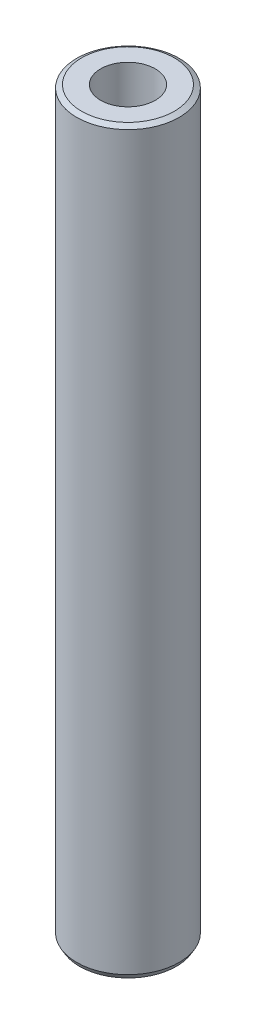
ISO-10303-21;
HEADER;
FILE_DESCRIPTION(('STEP AP214'),'2;1');
FILE_NAME('part.step','',(''),(''),'','','');
FILE_SCHEMA(('AUTOMOTIVE_DESIGN { 1 0 10303 214 1 1 1 1 }'));
ENDSEC;
DATA;
#1=APPLICATION_CONTEXT('core data for automotive mechanical design processes');
#2=APPLICATION_PROTOCOL_DEFINITION('international standard','automotive_design',2000,#1);
#3=PRODUCT_CONTEXT('',#1,'mechanical');
#4=PRODUCT('Part','Part','',(#3));
#5=PRODUCT_RELATED_PRODUCT_CATEGORY('part','',(#4));
#6=PRODUCT_DEFINITION_FORMATION('','',#4);
#7=PRODUCT_DEFINITION_CONTEXT('part definition',#1,'design');
#8=PRODUCT_DEFINITION('design','',#6,#7);
#9=PRODUCT_DEFINITION_SHAPE('','',#8);
#10=(LENGTH_UNIT() NAMED_UNIT(*) SI_UNIT(.MILLI.,.METRE.));
#11=(NAMED_UNIT(*) PLANE_ANGLE_UNIT() SI_UNIT($,.RADIAN.));
#12=(NAMED_UNIT(*) SI_UNIT($,.STERADIAN.) SOLID_ANGLE_UNIT());
#13=UNCERTAINTY_MEASURE_WITH_UNIT(LENGTH_MEASURE(1.E-05),#10,'distance_accuracy_value','');
#14=(GEOMETRIC_REPRESENTATION_CONTEXT(3) GLOBAL_UNCERTAINTY_ASSIGNED_CONTEXT((#13)) GLOBAL_UNIT_ASSIGNED_CONTEXT((#10,
#11,#12)) REPRESENTATION_CONTEXT('',''));
#15=CARTESIAN_POINT('',(0.,0.,0.));
#16=DIRECTION('',(0.,0.,1.));
#17=DIRECTION('',(1.,0.,0.));
#18=AXIS2_PLACEMENT_3D('',#15,#16,#17);
#19=CARTESIAN_POINT('',(0.,288.719500473334,0.));
#20=DIRECTION('',(0.,-1.,0.));
#21=DIRECTION('',(0.,0.,-1.));
#22=AXIS2_PLACEMENT_3D('',#19,#20,#21);
#23=CYLINDRICAL_SURFACE('',#22,20.);
#24=CARTESIAN_POINT('',(0.,287.617443691525,0.));
#25=DIRECTION('',(0.,1.,0.));
#26=DIRECTION('',(0.,0.,1.));
#27=AXIS2_PLACEMENT_3D('',#24,#25,#26);
#28=CIRCLE('',#27,20.);
#29=CARTESIAN_POINT('',(0.,287.617443691525,20.));
#30=VERTEX_POINT('',#29);
#31=EDGE_CURVE('E50',#30,#30,#28,.F.);
#32=ORIENTED_EDGE('',*,*,#31,.T.);
#33=EDGE_LOOP('',(#32));
#34=FACE_BOUND('',#33,.T.);
#35=CARTESIAN_POINT('',(0.,1.90881833891887,0.));
#36=DIRECTION('',(0.,1.,0.));
#37=DIRECTION('',(0.,0.,1.));
#38=AXIS2_PLACEMENT_3D('',#35,#36,#37);
#39=CIRCLE('',#38,20.);
#40=CARTESIAN_POINT('',(0.,1.90881833891887,20.));
#41=VERTEX_POINT('',#40);
#42=EDGE_CURVE('E51',#41,#41,#39,.T.);
#43=ORIENTED_EDGE('',*,*,#42,.T.);
#44=EDGE_LOOP('',(#43));
#45=FACE_BOUND('',#44,.T.);
#46=ADVANCED_FACE('F39',(#34,#45),#23,.T.);
#47=CARTESIAN_POINT('',(0.,288.719500473334,0.));
#48=DIRECTION('',(0.,1.,0.));
#49=DIRECTION('',(0.,0.,1.));
#50=AXIS2_PLACEMENT_3D('',#47,#48,#49);
#51=PLANE('',#50);
#52=CARTESIAN_POINT('',(0.,288.719500473334,0.));
#53=DIRECTION('',(0.,1.,0.));
#54=DIRECTION('',(0.,0.,1.));
#55=AXIS2_PLACEMENT_3D('',#52,#53,#54);
#56=CIRCLE('',#55,18.0911816610814);
#57=CARTESIAN_POINT('',(0.,288.719500473334,18.0911816610814));
#58=VERTEX_POINT('',#57);
#59=EDGE_CURVE('E54',#58,#58,#56,.T.);
#60=ORIENTED_EDGE('',*,*,#59,.T.);
#61=EDGE_LOOP('',(#60));
#62=FACE_BOUND('',#61,.T.);
#63=CARTESIAN_POINT('',(0.,288.719500473334,0.));
#64=DIRECTION('',(0.,1.,0.));
#65=DIRECTION('',(0.,0.,1.));
#66=AXIS2_PLACEMENT_3D('',#63,#64,#65);
#67=CIRCLE('',#66,10.6688998778868);
#68=CARTESIAN_POINT('',(0.,288.719500473334,10.6688998778868));
#69=VERTEX_POINT('',#68);
#70=EDGE_CURVE('E58',#69,#69,#67,.T.);
#71=ORIENTED_EDGE('',*,*,#70,.F.);
#72=EDGE_LOOP('',(#71));
#73=FACE_BOUND('',#72,.T.);
#74=ADVANCED_FACE('F69',(#62,#73),#51,.T.);
#75=CARTESIAN_POINT('',(0.,0.,0.));
#76=DIRECTION('',(0.,1.,0.));
#77=DIRECTION('',(0.,0.,1.));
#78=AXIS2_PLACEMENT_3D('',#75,#76,#77);
#79=PLANE('',#78);
#80=CARTESIAN_POINT('',(0.,0.,0.));
#81=DIRECTION('',(0.,1.,0.));
#82=DIRECTION('',(0.,0.,1.));
#83=AXIS2_PLACEMENT_3D('',#80,#81,#82);
#84=CIRCLE('',#83,18.8979432181911);
#85=CARTESIAN_POINT('',(0.,0.,18.8979432181911));
#86=VERTEX_POINT('',#85);
#87=EDGE_CURVE('E10',#86,#86,#84,.F.);
#88=ORIENTED_EDGE('',*,*,#87,.T.);
#89=EDGE_LOOP('',(#88));
#90=FACE_BOUND('',#89,.T.);
#91=CARTESIAN_POINT('',(0.,0.,0.));
#92=DIRECTION('',(0.,1.,0.));
#93=DIRECTION('',(0.,0.,1.));
#94=AXIS2_PLACEMENT_3D('',#91,#92,#93);
#95=CIRCLE('',#94,10.6688998778868);
#96=CARTESIAN_POINT('',(0.,0.,10.6688998778868));
#97=VERTEX_POINT('',#96);
#98=EDGE_CURVE('E63',#97,#97,#95,.T.);
#99=ORIENTED_EDGE('',*,*,#98,.T.);
#100=EDGE_LOOP('',(#99));
#101=FACE_BOUND('',#100,.T.);
#102=ADVANCED_FACE('F75',(#90,#101),#79,.F.);
#103=CARTESIAN_POINT('',(0.,288.719500473334,0.));
#104=DIRECTION('',(0.,-1.,0.));
#105=DIRECTION('',(0.,0.,-1.));
#106=AXIS2_PLACEMENT_3D('',#103,#104,#105);
#107=CYLINDRICAL_SURFACE('',#106,10.6688998778868);
#108=ORIENTED_EDGE('',*,*,#70,.T.);
#109=EDGE_LOOP('',(#108));
#110=FACE_BOUND('',#109,.T.);
#111=ORIENTED_EDGE('',*,*,#98,.F.);
#112=EDGE_LOOP('',(#111));
#113=FACE_BOUND('',#112,.T.);
#114=ADVANCED_FACE('F70',(#110,#113),#107,.F.);
#115=CARTESIAN_POINT('',(0.,288.719500473334,0.));
#116=DIRECTION('',(0.,-1.,0.));
#117=DIRECTION('',(0.,0.,-1.));
#118=AXIS2_PLACEMENT_3D('',#115,#116,#117);
#119=CONICAL_SURFACE('',#118,18.0911816610814,1.04719755119658);
#120=ORIENTED_EDGE('',*,*,#31,.F.);
#121=EDGE_LOOP('',(#120));
#122=FACE_BOUND('',#121,.T.);
#123=ORIENTED_EDGE('',*,*,#59,.F.);
#124=EDGE_LOOP('',(#123));
#125=FACE_BOUND('',#124,.T.);
#126=ADVANCED_FACE('F81',(#122,#125),#119,.T.);
#127=CARTESIAN_POINT('',(0.,1.90881833891887,0.));
#128=DIRECTION('',(0.,1.,0.));
#129=DIRECTION('',(0.,0.,1.));
#130=AXIS2_PLACEMENT_3D('',#127,#128,#129);
#131=CONICAL_SURFACE('',#130,20.,0.523598775598306);
#132=ORIENTED_EDGE('',*,*,#87,.F.);
#133=EDGE_LOOP('',(#132));
#134=FACE_BOUND('',#133,.T.);
#135=ORIENTED_EDGE('',*,*,#42,.F.);
#136=EDGE_LOOP('',(#135));
#137=FACE_BOUND('',#136,.T.);
#138=ADVANCED_FACE('F45',(#134,#137),#131,.T.);
#139=CLOSED_SHELL('',(#46,#74,#102,#114,#126,#138));
#140=MANIFOLD_SOLID_BREP('B2',#139);
#141=ADVANCED_BREP_SHAPE_REPRESENTATION('',(#18,#140),#14);
#142=SHAPE_DEFINITION_REPRESENTATION(#9,#141);
ENDSEC;
END-ISO-10303-21;
